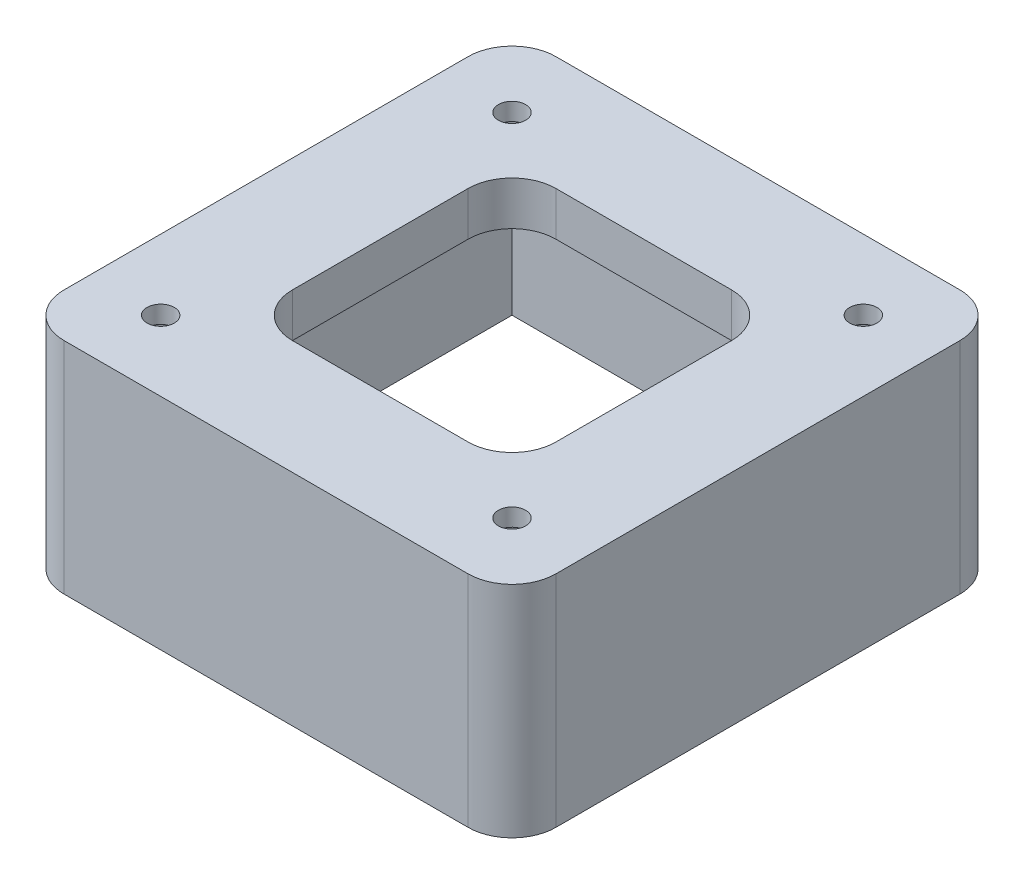
ISO-10303-21;
HEADER;
FILE_DESCRIPTION(('STEP AP214'),'2;1');
FILE_NAME('part.step','',(''),(''),'','','');
FILE_SCHEMA(('AUTOMOTIVE_DESIGN { 1 0 10303 214 1 1 1 1 }'));
ENDSEC;
DATA;
#1=APPLICATION_CONTEXT('core data for automotive mechanical design processes');
#2=APPLICATION_PROTOCOL_DEFINITION('international standard','automotive_design',2000,#1);
#3=PRODUCT_CONTEXT('',#1,'mechanical');
#4=PRODUCT('Part','Part','',(#3));
#5=PRODUCT_RELATED_PRODUCT_CATEGORY('part','',(#4));
#6=PRODUCT_DEFINITION_FORMATION('','',#4);
#7=PRODUCT_DEFINITION_CONTEXT('part definition',#1,'design');
#8=PRODUCT_DEFINITION('design','',#6,#7);
#9=PRODUCT_DEFINITION_SHAPE('','',#8);
#10=(LENGTH_UNIT() NAMED_UNIT(*) SI_UNIT(.MILLI.,.METRE.));
#11=(NAMED_UNIT(*) PLANE_ANGLE_UNIT() SI_UNIT($,.RADIAN.));
#12=(NAMED_UNIT(*) SI_UNIT($,.STERADIAN.) SOLID_ANGLE_UNIT());
#13=UNCERTAINTY_MEASURE_WITH_UNIT(LENGTH_MEASURE(1.E-05),#10,'distance_accuracy_value','');
#14=(GEOMETRIC_REPRESENTATION_CONTEXT(3) GLOBAL_UNCERTAINTY_ASSIGNED_CONTEXT((#13)) GLOBAL_UNIT_ASSIGNED_CONTEXT((#10,
#11,#12)) REPRESENTATION_CONTEXT('',''));
#15=CARTESIAN_POINT('',(0.,0.,0.));
#16=DIRECTION('',(0.,0.,1.));
#17=DIRECTION('',(1.,0.,0.));
#18=AXIS2_PLACEMENT_3D('',#15,#16,#17);
#19=CARTESIAN_POINT('',(-20.,5.,20.));
#20=DIRECTION('',(0.,-1.,0.));
#21=DIRECTION('',(0.,0.,-1.));
#22=AXIS2_PLACEMENT_3D('',#19,#20,#21);
#23=CYLINDRICAL_SURFACE('',#22,1.55);
#24=CARTESIAN_POINT('',(-20.,5.,20.));
#25=DIRECTION('',(0.,1.,0.));
#26=DIRECTION('',(0.,0.,1.));
#27=AXIS2_PLACEMENT_3D('',#24,#25,#26);
#28=CIRCLE('',#27,1.55);
#29=CARTESIAN_POINT('',(-20.,5.,21.55));
#30=VERTEX_POINT('',#29);
#31=EDGE_CURVE('E268',#30,#30,#28,.T.);
#32=ORIENTED_EDGE('',*,*,#31,.T.);
#33=EDGE_LOOP('',(#32));
#34=FACE_BOUND('',#33,.T.);
#35=CARTESIAN_POINT('',(-20.,3.,20.));
#36=DIRECTION('',(0.,-1.,0.));
#37=DIRECTION('',(0.,0.,-1.));
#38=AXIS2_PLACEMENT_3D('',#35,#36,#37);
#39=CIRCLE('',#38,1.55);
#40=CARTESIAN_POINT('',(-20.,3.,18.45));
#41=VERTEX_POINT('',#40);
#42=EDGE_CURVE('E231',#41,#41,#39,.T.);
#43=ORIENTED_EDGE('',*,*,#42,.T.);
#44=EDGE_LOOP('',(#43));
#45=FACE_BOUND('',#44,.T.);
#46=ADVANCED_FACE('F34',(#34,#45),#23,.F.);
#47=CARTESIAN_POINT('',(20.,5.,-20.));
#48=DIRECTION('',(0.,-1.,0.));
#49=DIRECTION('',(0.,0.,-1.));
#50=AXIS2_PLACEMENT_3D('',#47,#48,#49);
#51=CYLINDRICAL_SURFACE('',#50,1.55);
#52=CARTESIAN_POINT('',(20.,5.,-20.));
#53=DIRECTION('',(0.,1.,0.));
#54=DIRECTION('',(0.,0.,1.));
#55=AXIS2_PLACEMENT_3D('',#52,#53,#54);
#56=CIRCLE('',#55,1.55);
#57=CARTESIAN_POINT('',(20.,5.,-18.45));
#58=VERTEX_POINT('',#57);
#59=EDGE_CURVE('E285',#58,#58,#56,.T.);
#60=ORIENTED_EDGE('',*,*,#59,.T.);
#61=EDGE_LOOP('',(#60));
#62=FACE_BOUND('',#61,.T.);
#63=CARTESIAN_POINT('',(20.,3.,-20.));
#64=DIRECTION('',(0.,-1.,0.));
#65=DIRECTION('',(0.,0.,-1.));
#66=AXIS2_PLACEMENT_3D('',#63,#64,#65);
#67=CIRCLE('',#66,1.55);
#68=CARTESIAN_POINT('',(20.,3.,-21.55));
#69=VERTEX_POINT('',#68);
#70=EDGE_CURVE('E237',#69,#69,#67,.T.);
#71=ORIENTED_EDGE('',*,*,#70,.T.);
#72=EDGE_LOOP('',(#71));
#73=FACE_BOUND('',#72,.T.);
#74=ADVANCED_FACE('F413',(#62,#73),#51,.F.);
#75=CARTESIAN_POINT('',(-20.,5.,-20.));
#76=DIRECTION('',(0.,-1.,0.));
#77=DIRECTION('',(0.,0.,-1.));
#78=AXIS2_PLACEMENT_3D('',#75,#76,#77);
#79=CYLINDRICAL_SURFACE('',#78,1.55);
#80=CARTESIAN_POINT('',(-20.,5.,-20.));
#81=DIRECTION('',(0.,1.,0.));
#82=DIRECTION('',(0.,0.,1.));
#83=AXIS2_PLACEMENT_3D('',#80,#81,#82);
#84=CIRCLE('',#83,1.55);
#85=CARTESIAN_POINT('',(-20.,5.,-18.45));
#86=VERTEX_POINT('',#85);
#87=EDGE_CURVE('E288',#86,#86,#84,.T.);
#88=ORIENTED_EDGE('',*,*,#87,.T.);
#89=EDGE_LOOP('',(#88));
#90=FACE_BOUND('',#89,.T.);
#91=CARTESIAN_POINT('',(-20.,3.,-20.));
#92=DIRECTION('',(0.,-1.,0.));
#93=DIRECTION('',(0.,0.,-1.));
#94=AXIS2_PLACEMENT_3D('',#91,#92,#93);
#95=CIRCLE('',#94,1.55);
#96=CARTESIAN_POINT('',(-20.,3.,-21.55));
#97=VERTEX_POINT('',#96);
#98=EDGE_CURVE('E244',#97,#97,#95,.T.);
#99=ORIENTED_EDGE('',*,*,#98,.T.);
#100=EDGE_LOOP('',(#99));
#101=FACE_BOUND('',#100,.T.);
#102=ADVANCED_FACE('F419',(#90,#101),#79,.F.);
#103=CARTESIAN_POINT('',(20.,5.,20.));
#104=DIRECTION('',(0.,-1.,0.));
#105=DIRECTION('',(0.,0.,-1.));
#106=AXIS2_PLACEMENT_3D('',#103,#104,#105);
#107=CYLINDRICAL_SURFACE('',#106,1.55);
#108=CARTESIAN_POINT('',(20.,5.,20.));
#109=DIRECTION('',(0.,1.,0.));
#110=DIRECTION('',(0.,0.,1.));
#111=AXIS2_PLACEMENT_3D('',#108,#109,#110);
#112=CIRCLE('',#111,1.55);
#113=CARTESIAN_POINT('',(20.,5.,21.55));
#114=VERTEX_POINT('',#113);
#115=EDGE_CURVE('E282',#114,#114,#112,.T.);
#116=ORIENTED_EDGE('',*,*,#115,.T.);
#117=EDGE_LOOP('',(#116));
#118=FACE_BOUND('',#117,.T.);
#119=CARTESIAN_POINT('',(20.,3.,20.));
#120=DIRECTION('',(0.,-1.,0.));
#121=DIRECTION('',(0.,0.,-1.));
#122=AXIS2_PLACEMENT_3D('',#119,#120,#121);
#123=CIRCLE('',#122,1.55);
#124=CARTESIAN_POINT('',(20.,3.,18.45));
#125=VERTEX_POINT('',#124);
#126=EDGE_CURVE('E251',#125,#125,#123,.T.);
#127=ORIENTED_EDGE('',*,*,#126,.T.);
#128=EDGE_LOOP('',(#127));
#129=FACE_BOUND('',#128,.T.);
#130=ADVANCED_FACE('F427',(#118,#129),#107,.F.);
#131=CARTESIAN_POINT('',(0.,5.,0.));
#132=DIRECTION('',(0.,1.,0.));
#133=DIRECTION('',(0.,0.,1.));
#134=AXIS2_PLACEMENT_3D('',#131,#132,#133);
#135=PLANE('',#134);
#136=ORIENTED_EDGE('',*,*,#115,.F.);
#137=EDGE_LOOP('',(#136));
#138=FACE_BOUND('',#137,.T.);
#139=ORIENTED_EDGE('',*,*,#87,.F.);
#140=EDGE_LOOP('',(#139));
#141=FACE_BOUND('',#140,.T.);
#142=DIRECTION('',(1.,0.,0.));
#143=VECTOR('',#142,1.);
#144=CARTESIAN_POINT('',(28.,5.,28.));
#145=LINE('',#144,#143);
#146=CARTESIAN_POINT('',(-23.,5.,28.));
#147=VERTEX_POINT('',#146);
#148=CARTESIAN_POINT('',(23.,5.,28.));
#149=VERTEX_POINT('',#148);
#150=EDGE_CURVE('E294',#147,#149,#145,.T.);
#151=ORIENTED_EDGE('',*,*,#150,.T.);
#152=CARTESIAN_POINT('',(23.,5.,23.));
#153=DIRECTION('',(0.,1.,0.));
#154=DIRECTION('',(0.,0.,1.));
#155=AXIS2_PLACEMENT_3D('',#152,#153,#154);
#156=CIRCLE('',#155,5.);
#157=CARTESIAN_POINT('',(28.,5.,23.));
#158=VERTEX_POINT('',#157);
#159=EDGE_CURVE('E368',#149,#158,#156,.T.);
#160=ORIENTED_EDGE('',*,*,#159,.T.);
#161=DIRECTION('',(0.,0.,-1.));
#162=VECTOR('',#161,1.);
#163=CARTESIAN_POINT('',(28.,5.,28.));
#164=LINE('',#163,#162);
#165=CARTESIAN_POINT('',(28.,5.,-23.));
#166=VERTEX_POINT('',#165);
#167=EDGE_CURVE('E297',#158,#166,#164,.T.);
#168=ORIENTED_EDGE('',*,*,#167,.T.);
#169=CARTESIAN_POINT('',(23.,5.,-23.));
#170=DIRECTION('',(0.,1.,0.));
#171=DIRECTION('',(0.,0.,1.));
#172=AXIS2_PLACEMENT_3D('',#169,#170,#171);
#173=CIRCLE('',#172,5.);
#174=CARTESIAN_POINT('',(23.,5.,-28.));
#175=VERTEX_POINT('',#174);
#176=EDGE_CURVE('E56',#166,#175,#173,.T.);
#177=ORIENTED_EDGE('',*,*,#176,.T.);
#178=DIRECTION('',(-1.,0.,0.));
#179=VECTOR('',#178,1.);
#180=CARTESIAN_POINT('',(28.,5.,-28.));
#181=LINE('',#180,#179);
#182=CARTESIAN_POINT('',(-23.,5.,-28.));
#183=VERTEX_POINT('',#182);
#184=EDGE_CURVE('E299',#175,#183,#181,.T.);
#185=ORIENTED_EDGE('',*,*,#184,.T.);
#186=CARTESIAN_POINT('',(-23.,5.,-23.));
#187=DIRECTION('',(0.,1.,0.));
#188=DIRECTION('',(0.,0.,1.));
#189=AXIS2_PLACEMENT_3D('',#186,#187,#188);
#190=CIRCLE('',#189,5.);
#191=CARTESIAN_POINT('',(-28.,5.,-23.));
#192=VERTEX_POINT('',#191);
#193=EDGE_CURVE('E365',#183,#192,#190,.T.);
#194=ORIENTED_EDGE('',*,*,#193,.T.);
#195=DIRECTION('',(0.,0.,1.));
#196=VECTOR('',#195,1.);
#197=CARTESIAN_POINT('',(-28.,5.,28.));
#198=LINE('',#197,#196);
#199=CARTESIAN_POINT('',(-28.,5.,23.));
#200=VERTEX_POINT('',#199);
#201=EDGE_CURVE('E291',#192,#200,#198,.T.);
#202=ORIENTED_EDGE('',*,*,#201,.T.);
#203=CARTESIAN_POINT('',(-23.,5.,23.));
#204=DIRECTION('',(0.,1.,0.));
#205=DIRECTION('',(0.,0.,1.));
#206=AXIS2_PLACEMENT_3D('',#203,#204,#205);
#207=CIRCLE('',#206,5.);
#208=EDGE_CURVE('E363',#200,#147,#207,.T.);
#209=ORIENTED_EDGE('',*,*,#208,.T.);
#210=EDGE_LOOP('',(#151,#160,#168,#177,#185,#194,#202,#209));
#211=FACE_BOUND('',#210,.T.);
#212=ORIENTED_EDGE('',*,*,#59,.F.);
#213=EDGE_LOOP('',(#212));
#214=FACE_BOUND('',#213,.T.);
#215=ORIENTED_EDGE('',*,*,#31,.F.);
#216=EDGE_LOOP('',(#215));
#217=FACE_BOUND('',#216,.T.);
#218=DIRECTION('',(-1.,0.,0.));
#219=VECTOR('',#218,1.);
#220=CARTESIAN_POINT('',(-15.,5.,-15.));
#221=LINE('',#220,#219);
#222=CARTESIAN_POINT('',(10.,5.,-15.));
#223=VERTEX_POINT('',#222);
#224=CARTESIAN_POINT('',(-10.,5.,-15.));
#225=VERTEX_POINT('',#224);
#226=EDGE_CURVE('E258',#223,#225,#221,.T.);
#227=ORIENTED_EDGE('',*,*,#226,.F.);
#228=CARTESIAN_POINT('',(10.,5.,-10.));
#229=DIRECTION('',(0.,1.,0.));
#230=DIRECTION('',(0.,0.,1.));
#231=AXIS2_PLACEMENT_3D('',#228,#229,#230);
#232=CIRCLE('',#231,5.);
#233=CARTESIAN_POINT('',(15.,5.,-10.));
#234=VERTEX_POINT('',#233);
#235=EDGE_CURVE('E335',#223,#234,#232,.F.);
#236=ORIENTED_EDGE('',*,*,#235,.T.);
#237=DIRECTION('',(0.,0.,-1.));
#238=VECTOR('',#237,1.);
#239=CARTESIAN_POINT('',(15.,5.,15.));
#240=LINE('',#239,#238);
#241=CARTESIAN_POINT('',(15.,5.,9.99999999999999));
#242=VERTEX_POINT('',#241);
#243=EDGE_CURVE('E255',#242,#234,#240,.T.);
#244=ORIENTED_EDGE('',*,*,#243,.F.);
#245=CARTESIAN_POINT('',(10.,5.,9.99999999999999));
#246=DIRECTION('',(0.,1.,0.));
#247=DIRECTION('',(0.,0.,1.));
#248=AXIS2_PLACEMENT_3D('',#245,#246,#247);
#249=CIRCLE('',#248,5.);
#250=CARTESIAN_POINT('',(10.,5.,15.));
#251=VERTEX_POINT('',#250);
#252=EDGE_CURVE('E339',#242,#251,#249,.F.);
#253=ORIENTED_EDGE('',*,*,#252,.T.);
#254=DIRECTION('',(1.,0.,0.));
#255=VECTOR('',#254,1.);
#256=CARTESIAN_POINT('',(-15.,5.,15.));
#257=LINE('',#256,#255);
#258=CARTESIAN_POINT('',(-10.,5.,15.));
#259=VERTEX_POINT('',#258);
#260=EDGE_CURVE('E265',#259,#251,#257,.T.);
#261=ORIENTED_EDGE('',*,*,#260,.F.);
#262=CARTESIAN_POINT('',(-10.,5.,9.99999999999999));
#263=DIRECTION('',(0.,1.,0.));
#264=DIRECTION('',(0.,0.,1.));
#265=AXIS2_PLACEMENT_3D('',#262,#263,#264);
#266=CIRCLE('',#265,5.);
#267=CARTESIAN_POINT('',(-15.,5.,9.99999999999999));
#268=VERTEX_POINT('',#267);
#269=EDGE_CURVE('E343',#259,#268,#266,.F.);
#270=ORIENTED_EDGE('',*,*,#269,.T.);
#271=DIRECTION('',(0.,0.,1.));
#272=VECTOR('',#271,1.);
#273=CARTESIAN_POINT('',(-15.,5.,15.));
#274=LINE('',#273,#272);
#275=CARTESIAN_POINT('',(-15.,5.,-10.));
#276=VERTEX_POINT('',#275);
#277=EDGE_CURVE('E262',#276,#268,#274,.T.);
#278=ORIENTED_EDGE('',*,*,#277,.F.);
#279=CARTESIAN_POINT('',(-10.,5.,-10.));
#280=DIRECTION('',(0.,1.,0.));
#281=DIRECTION('',(0.,0.,1.));
#282=AXIS2_PLACEMENT_3D('',#279,#280,#281);
#283=CIRCLE('',#282,5.);
#284=EDGE_CURVE('E331',#276,#225,#283,.F.);
#285=ORIENTED_EDGE('',*,*,#284,.T.);
#286=EDGE_LOOP('',(#227,#236,#244,#253,#261,#270,#278,#285));
#287=FACE_BOUND('',#286,.T.);
#288=ADVANCED_FACE('F381',(#138,#141,#211,#214,#217,#287),#135,.T.);
#289=CARTESIAN_POINT('',(0.,0.,0.));
#290=DIRECTION('',(0.,1.,0.));
#291=DIRECTION('',(0.,0.,1.));
#292=AXIS2_PLACEMENT_3D('',#289,#290,#291);
#293=PLANE('',#292);
#294=DIRECTION('',(0.,0.,1.));
#295=VECTOR('',#294,1.);
#296=CARTESIAN_POINT('',(25.,0.,-25.));
#297=LINE('',#296,#295);
#298=CARTESIAN_POINT('',(25.,0.,-25.));
#299=VERTEX_POINT('',#298);
#300=CARTESIAN_POINT('',(25.,0.,25.));
#301=VERTEX_POINT('',#300);
#302=EDGE_CURVE('E185',#299,#301,#297,.T.);
#303=ORIENTED_EDGE('',*,*,#302,.T.);
#304=DIRECTION('',(-1.,0.,0.));
#305=VECTOR('',#304,1.);
#306=CARTESIAN_POINT('',(25.,0.,25.));
#307=LINE('',#306,#305);
#308=CARTESIAN_POINT('',(-25.,0.,25.));
#309=VERTEX_POINT('',#308);
#310=EDGE_CURVE('E204',#301,#309,#307,.T.);
#311=ORIENTED_EDGE('',*,*,#310,.T.);
#312=DIRECTION('',(0.,0.,-1.));
#313=VECTOR('',#312,1.);
#314=CARTESIAN_POINT('',(-25.,0.,25.));
#315=LINE('',#314,#313);
#316=CARTESIAN_POINT('',(-25.,0.,-25.));
#317=VERTEX_POINT('',#316);
#318=EDGE_CURVE('E191',#309,#317,#315,.T.);
#319=ORIENTED_EDGE('',*,*,#318,.T.);
#320=DIRECTION('',(1.,0.,0.));
#321=VECTOR('',#320,1.);
#322=CARTESIAN_POINT('',(-25.,0.,-25.));
#323=LINE('',#322,#321);
#324=EDGE_CURVE('E207',#317,#299,#323,.T.);
#325=ORIENTED_EDGE('',*,*,#324,.T.);
#326=EDGE_LOOP('',(#303,#311,#319,#325));
#327=FACE_BOUND('',#326,.T.);
#328=CARTESIAN_POINT('',(-20.,0.,20.));
#329=DIRECTION('',(0.,-1.,0.));
#330=DIRECTION('',(0.,0.,-1.));
#331=AXIS2_PLACEMENT_3D('',#328,#329,#330);
#332=CIRCLE('',#331,3.55);
#333=CARTESIAN_POINT('',(-20.,0.,16.45));
#334=VERTEX_POINT('',#333);
#335=EDGE_CURVE('E227',#334,#334,#332,.T.);
#336=ORIENTED_EDGE('',*,*,#335,.F.);
#337=EDGE_LOOP('',(#336));
#338=FACE_BOUND('',#337,.T.);
#339=CARTESIAN_POINT('',(20.,0.,-20.));
#340=DIRECTION('',(0.,-1.,0.));
#341=DIRECTION('',(0.,0.,-1.));
#342=AXIS2_PLACEMENT_3D('',#339,#340,#341);
#343=CIRCLE('',#342,3.55);
#344=CARTESIAN_POINT('',(20.,0.,-23.55));
#345=VERTEX_POINT('',#344);
#346=EDGE_CURVE('E238',#345,#345,#343,.T.);
#347=ORIENTED_EDGE('',*,*,#346,.F.);
#348=EDGE_LOOP('',(#347));
#349=FACE_BOUND('',#348,.T.);
#350=CARTESIAN_POINT('',(-20.,0.,-20.));
#351=DIRECTION('',(0.,-1.,0.));
#352=DIRECTION('',(0.,0.,-1.));
#353=AXIS2_PLACEMENT_3D('',#350,#351,#352);
#354=CIRCLE('',#353,3.55);
#355=CARTESIAN_POINT('',(-20.,0.,-23.55));
#356=VERTEX_POINT('',#355);
#357=EDGE_CURVE('E245',#356,#356,#354,.T.);
#358=ORIENTED_EDGE('',*,*,#357,.F.);
#359=EDGE_LOOP('',(#358));
#360=FACE_BOUND('',#359,.T.);
#361=CARTESIAN_POINT('',(20.,0.,20.));
#362=DIRECTION('',(0.,-1.,0.));
#363=DIRECTION('',(0.,0.,-1.));
#364=AXIS2_PLACEMENT_3D('',#361,#362,#363);
#365=CIRCLE('',#364,3.55);
#366=CARTESIAN_POINT('',(20.,0.,16.45));
#367=VERTEX_POINT('',#366);
#368=EDGE_CURVE('E252',#367,#367,#365,.T.);
#369=ORIENTED_EDGE('',*,*,#368,.F.);
#370=EDGE_LOOP('',(#369));
#371=FACE_BOUND('',#370,.T.);
#372=DIRECTION('',(1.,0.,0.));
#373=VECTOR('',#372,1.);
#374=CARTESIAN_POINT('',(-15.,0.,15.));
#375=LINE('',#374,#373);
#376=CARTESIAN_POINT('',(-10.,0.,15.));
#377=VERTEX_POINT('',#376);
#378=CARTESIAN_POINT('',(10.,0.,15.));
#379=VERTEX_POINT('',#378);
#380=EDGE_CURVE('E259',#377,#379,#375,.T.);
#381=ORIENTED_EDGE('',*,*,#380,.T.);
#382=CARTESIAN_POINT('',(10.,0.,9.99999999999999));
#383=DIRECTION('',(0.,1.,0.));
#384=DIRECTION('',(0.,0.,1.));
#385=AXIS2_PLACEMENT_3D('',#382,#383,#384);
#386=CIRCLE('',#385,5.);
#387=CARTESIAN_POINT('',(15.,0.,9.99999999999999));
#388=VERTEX_POINT('',#387);
#389=EDGE_CURVE('E337',#379,#388,#386,.T.);
#390=ORIENTED_EDGE('',*,*,#389,.T.);
#391=DIRECTION('',(0.,0.,-1.));
#392=VECTOR('',#391,1.);
#393=CARTESIAN_POINT('',(15.,0.,15.));
#394=LINE('',#393,#392);
#395=CARTESIAN_POINT('',(15.,0.,-10.));
#396=VERTEX_POINT('',#395);
#397=EDGE_CURVE('E269',#388,#396,#394,.T.);
#398=ORIENTED_EDGE('',*,*,#397,.T.);
#399=CARTESIAN_POINT('',(10.,0.,-10.));
#400=DIRECTION('',(0.,1.,0.));
#401=DIRECTION('',(0.,0.,1.));
#402=AXIS2_PLACEMENT_3D('',#399,#400,#401);
#403=CIRCLE('',#402,5.);
#404=CARTESIAN_POINT('',(10.,0.,-15.));
#405=VERTEX_POINT('',#404);
#406=EDGE_CURVE('E333',#396,#405,#403,.T.);
#407=ORIENTED_EDGE('',*,*,#406,.T.);
#408=DIRECTION('',(-1.,0.,0.));
#409=VECTOR('',#408,1.);
#410=CARTESIAN_POINT('',(-15.,0.,-15.));
#411=LINE('',#410,#409);
#412=CARTESIAN_POINT('',(-10.,0.,-15.));
#413=VERTEX_POINT('',#412);
#414=EDGE_CURVE('E272',#405,#413,#411,.T.);
#415=ORIENTED_EDGE('',*,*,#414,.T.);
#416=CARTESIAN_POINT('',(-10.,0.,-10.));
#417=DIRECTION('',(0.,1.,0.));
#418=DIRECTION('',(0.,0.,1.));
#419=AXIS2_PLACEMENT_3D('',#416,#417,#418);
#420=CIRCLE('',#419,5.);
#421=CARTESIAN_POINT('',(-15.,0.,-10.));
#422=VERTEX_POINT('',#421);
#423=EDGE_CURVE('E329',#413,#422,#420,.T.);
#424=ORIENTED_EDGE('',*,*,#423,.T.);
#425=DIRECTION('',(0.,0.,1.));
#426=VECTOR('',#425,1.);
#427=CARTESIAN_POINT('',(-15.,0.,15.));
#428=LINE('',#427,#426);
#429=CARTESIAN_POINT('',(-15.,0.,9.99999999999999));
#430=VERTEX_POINT('',#429);
#431=EDGE_CURVE('E275',#422,#430,#428,.T.);
#432=ORIENTED_EDGE('',*,*,#431,.T.);
#433=CARTESIAN_POINT('',(-10.,0.,9.99999999999999));
#434=DIRECTION('',(0.,1.,0.));
#435=DIRECTION('',(0.,0.,1.));
#436=AXIS2_PLACEMENT_3D('',#433,#434,#435);
#437=CIRCLE('',#436,5.);
#438=EDGE_CURVE('E341',#430,#377,#437,.T.);
#439=ORIENTED_EDGE('',*,*,#438,.T.);
#440=EDGE_LOOP('',(#381,#390,#398,#407,#415,#424,#432,#439));
#441=FACE_BOUND('',#440,.T.);
#442=ADVANCED_FACE('F436',(#327,#338,#349,#360,#371,#441),#293,.F.);
#443=CARTESIAN_POINT('',(-28.,5.,28.));
#444=DIRECTION('',(1.,0.,0.));
#445=DIRECTION('',(0.,0.,-1.));
#446=AXIS2_PLACEMENT_3D('',#443,#444,#445);
#447=PLANE('',#446);
#448=ORIENTED_EDGE('',*,*,#201,.F.);
#449=DIRECTION('',(0.,-1.,0.));
#450=VECTOR('',#449,1.);
#451=CARTESIAN_POINT('',(-28.,5.,-23.));
#452=LINE('',#451,#450);
#453=CARTESIAN_POINT('',(-28.,-20.,-23.));
#454=VERTEX_POINT('',#453);
#455=EDGE_CURVE('E11',#192,#454,#452,.T.);
#456=ORIENTED_EDGE('',*,*,#455,.T.);
#457=DIRECTION('',(0.,0.,-1.));
#458=VECTOR('',#457,1.);
#459=CARTESIAN_POINT('',(-28.,-20.,28.));
#460=LINE('',#459,#458);
#461=CARTESIAN_POINT('',(-28.,-20.,23.));
#462=VERTEX_POINT('',#461);
#463=EDGE_CURVE('E218',#462,#454,#460,.T.);
#464=ORIENTED_EDGE('',*,*,#463,.F.);
#465=DIRECTION('',(0.,-1.,0.));
#466=VECTOR('',#465,1.);
#467=CARTESIAN_POINT('',(-28.,5.,23.));
#468=LINE('',#467,#466);
#469=EDGE_CURVE('E42',#462,#200,#468,.F.);
#470=ORIENTED_EDGE('',*,*,#469,.T.);
#471=EDGE_LOOP('',(#448,#456,#464,#470));
#472=FACE_BOUND('',#471,.T.);
#473=ADVANCED_FACE('F377',(#472),#447,.F.);
#474=CARTESIAN_POINT('',(28.,5.,28.));
#475=DIRECTION('',(0.,0.,-1.));
#476=DIRECTION('',(-1.,0.,0.));
#477=AXIS2_PLACEMENT_3D('',#474,#475,#476);
#478=PLANE('',#477);
#479=DIRECTION('',(-1.,0.,0.));
#480=VECTOR('',#479,1.);
#481=CARTESIAN_POINT('',(28.,-20.,28.));
#482=LINE('',#481,#480);
#483=CARTESIAN_POINT('',(23.,-20.,28.));
#484=VERTEX_POINT('',#483);
#485=CARTESIAN_POINT('',(-23.,-20.,28.));
#486=VERTEX_POINT('',#485);
#487=EDGE_CURVE('E192',#484,#486,#482,.T.);
#488=ORIENTED_EDGE('',*,*,#487,.F.);
#489=DIRECTION('',(0.,-1.,0.));
#490=VECTOR('',#489,1.);
#491=CARTESIAN_POINT('',(23.,5.,28.));
#492=LINE('',#491,#490);
#493=EDGE_CURVE('E361',#484,#149,#492,.F.);
#494=ORIENTED_EDGE('',*,*,#493,.T.);
#495=ORIENTED_EDGE('',*,*,#150,.F.);
#496=DIRECTION('',(0.,-1.,0.));
#497=VECTOR('',#496,1.);
#498=CARTESIAN_POINT('',(-23.,5.,28.));
#499=LINE('',#498,#497);
#500=EDGE_CURVE('E358',#147,#486,#499,.T.);
#501=ORIENTED_EDGE('',*,*,#500,.T.);
#502=EDGE_LOOP('',(#488,#494,#495,#501));
#503=FACE_BOUND('',#502,.T.);
#504=ADVANCED_FACE('F388',(#503),#478,.F.);
#505=CARTESIAN_POINT('',(28.,5.,28.));
#506=DIRECTION('',(-1.,0.,0.));
#507=DIRECTION('',(0.,0.,1.));
#508=AXIS2_PLACEMENT_3D('',#505,#506,#507);
#509=PLANE('',#508);
#510=ORIENTED_EDGE('',*,*,#167,.F.);
#511=DIRECTION('',(0.,-1.,0.));
#512=VECTOR('',#511,1.);
#513=CARTESIAN_POINT('',(28.,5.,23.));
#514=LINE('',#513,#512);
#515=CARTESIAN_POINT('',(28.,-20.,23.));
#516=VERTEX_POINT('',#515);
#517=EDGE_CURVE('E347',#158,#516,#514,.T.);
#518=ORIENTED_EDGE('',*,*,#517,.T.);
#519=DIRECTION('',(0.,0.,1.));
#520=VECTOR('',#519,1.);
#521=CARTESIAN_POINT('',(28.,-20.,-28.));
#522=LINE('',#521,#520);
#523=CARTESIAN_POINT('',(28.,-20.,-23.));
#524=VERTEX_POINT('',#523);
#525=EDGE_CURVE('E224',#524,#516,#522,.T.);
#526=ORIENTED_EDGE('',*,*,#525,.F.);
#527=DIRECTION('',(0.,-1.,0.));
#528=VECTOR('',#527,1.);
#529=CARTESIAN_POINT('',(28.,5.,-23.));
#530=LINE('',#529,#528);
#531=EDGE_CURVE('E345',#524,#166,#530,.F.);
#532=ORIENTED_EDGE('',*,*,#531,.T.);
#533=EDGE_LOOP('',(#510,#518,#526,#532));
#534=FACE_BOUND('',#533,.T.);
#535=ADVANCED_FACE('F398',(#534),#509,.F.);
#536=CARTESIAN_POINT('',(28.,5.,-28.));
#537=DIRECTION('',(0.,0.,1.));
#538=DIRECTION('',(1.,0.,0.));
#539=AXIS2_PLACEMENT_3D('',#536,#537,#538);
#540=PLANE('',#539);
#541=ORIENTED_EDGE('',*,*,#184,.F.);
#542=DIRECTION('',(0.,-1.,0.));
#543=VECTOR('',#542,1.);
#544=CARTESIAN_POINT('',(23.,5.,-28.));
#545=LINE('',#544,#543);
#546=CARTESIAN_POINT('',(23.,-20.,-28.));
#547=VERTEX_POINT('',#546);
#548=EDGE_CURVE('E371',#175,#547,#545,.T.);
#549=ORIENTED_EDGE('',*,*,#548,.T.);
#550=DIRECTION('',(1.,0.,0.));
#551=VECTOR('',#550,1.);
#552=CARTESIAN_POINT('',(-28.,-20.,-28.));
#553=LINE('',#552,#551);
#554=CARTESIAN_POINT('',(-23.,-20.,-28.));
#555=VERTEX_POINT('',#554);
#556=EDGE_CURVE('E221',#555,#547,#553,.T.);
#557=ORIENTED_EDGE('',*,*,#556,.F.);
#558=DIRECTION('',(0.,-1.,0.));
#559=VECTOR('',#558,1.);
#560=CARTESIAN_POINT('',(-23.,5.,-28.));
#561=LINE('',#560,#559);
#562=EDGE_CURVE('E49',#555,#183,#561,.F.);
#563=ORIENTED_EDGE('',*,*,#562,.T.);
#564=EDGE_LOOP('',(#541,#549,#557,#563));
#565=FACE_BOUND('',#564,.T.);
#566=ADVANCED_FACE('F403',(#565),#540,.F.);
#567=CARTESIAN_POINT('',(15.,5.,15.));
#568=DIRECTION('',(-1.,0.,0.));
#569=DIRECTION('',(0.,0.,1.));
#570=AXIS2_PLACEMENT_3D('',#567,#568,#569);
#571=PLANE('',#570);
#572=ORIENTED_EDGE('',*,*,#243,.T.);
#573=DIRECTION('',(0.,-1.,0.));
#574=VECTOR('',#573,1.);
#575=CARTESIAN_POINT('',(15.,0.,-10.));
#576=LINE('',#575,#574);
#577=EDGE_CURVE('E321',#234,#396,#576,.T.);
#578=ORIENTED_EDGE('',*,*,#577,.T.);
#579=ORIENTED_EDGE('',*,*,#397,.F.);
#580=DIRECTION('',(0.,-1.,0.));
#581=VECTOR('',#580,1.);
#582=CARTESIAN_POINT('',(15.,5.,9.99999999999999));
#583=LINE('',#582,#581);
#584=EDGE_CURVE('E319',#388,#242,#583,.F.);
#585=ORIENTED_EDGE('',*,*,#584,.T.);
#586=EDGE_LOOP('',(#572,#578,#579,#585));
#587=FACE_BOUND('',#586,.T.);
#588=ADVANCED_FACE('F425',(#587),#571,.T.);
#589=CARTESIAN_POINT('',(-15.,5.,-15.));
#590=DIRECTION('',(0.,0.,1.));
#591=DIRECTION('',(1.,0.,0.));
#592=AXIS2_PLACEMENT_3D('',#589,#590,#591);
#593=PLANE('',#592);
#594=ORIENTED_EDGE('',*,*,#226,.T.);
#595=DIRECTION('',(0.,-1.,0.));
#596=VECTOR('',#595,1.);
#597=CARTESIAN_POINT('',(-10.,0.,-15.));
#598=LINE('',#597,#596);
#599=EDGE_CURVE('E311',#225,#413,#598,.T.);
#600=ORIENTED_EDGE('',*,*,#599,.T.);
#601=ORIENTED_EDGE('',*,*,#414,.F.);
#602=DIRECTION('',(0.,-1.,0.));
#603=VECTOR('',#602,1.);
#604=CARTESIAN_POINT('',(10.,5.,-15.));
#605=LINE('',#604,#603);
#606=EDGE_CURVE('E301',#405,#223,#605,.F.);
#607=ORIENTED_EDGE('',*,*,#606,.T.);
#608=EDGE_LOOP('',(#594,#600,#601,#607));
#609=FACE_BOUND('',#608,.T.);
#610=ADVANCED_FACE('F524',(#609),#593,.T.);
#611=CARTESIAN_POINT('',(-15.,5.,15.));
#612=DIRECTION('',(1.,0.,0.));
#613=DIRECTION('',(0.,0.,-1.));
#614=AXIS2_PLACEMENT_3D('',#611,#612,#613);
#615=PLANE('',#614);
#616=ORIENTED_EDGE('',*,*,#431,.F.);
#617=DIRECTION('',(0.,-1.,0.));
#618=VECTOR('',#617,1.);
#619=CARTESIAN_POINT('',(-15.,5.,-10.));
#620=LINE('',#619,#618);
#621=EDGE_CURVE('E317',#422,#276,#620,.F.);
#622=ORIENTED_EDGE('',*,*,#621,.T.);
#623=ORIENTED_EDGE('',*,*,#277,.T.);
#624=DIRECTION('',(0.,-1.,0.));
#625=VECTOR('',#624,1.);
#626=CARTESIAN_POINT('',(-15.,0.,9.99999999999999));
#627=LINE('',#626,#625);
#628=EDGE_CURVE('E314',#268,#430,#627,.T.);
#629=ORIENTED_EDGE('',*,*,#628,.T.);
#630=EDGE_LOOP('',(#616,#622,#623,#629));
#631=FACE_BOUND('',#630,.T.);
#632=ADVANCED_FACE('F521',(#631),#615,.T.);
#633=CARTESIAN_POINT('',(-15.,5.,15.));
#634=DIRECTION('',(0.,0.,-1.));
#635=DIRECTION('',(-1.,0.,0.));
#636=AXIS2_PLACEMENT_3D('',#633,#634,#635);
#637=PLANE('',#636);
#638=ORIENTED_EDGE('',*,*,#260,.T.);
#639=DIRECTION('',(0.,-1.,0.));
#640=VECTOR('',#639,1.);
#641=CARTESIAN_POINT('',(10.,0.,15.));
#642=LINE('',#641,#640);
#643=EDGE_CURVE('E326',#251,#379,#642,.T.);
#644=ORIENTED_EDGE('',*,*,#643,.T.);
#645=ORIENTED_EDGE('',*,*,#380,.F.);
#646=DIRECTION('',(0.,-1.,0.));
#647=VECTOR('',#646,1.);
#648=CARTESIAN_POINT('',(-10.,5.,15.));
#649=LINE('',#648,#647);
#650=EDGE_CURVE('E324',#377,#259,#649,.F.);
#651=ORIENTED_EDGE('',*,*,#650,.T.);
#652=EDGE_LOOP('',(#638,#644,#645,#651));
#653=FACE_BOUND('',#652,.T.);
#654=ADVANCED_FACE('F517',(#653),#637,.T.);
#655=CARTESIAN_POINT('',(20.,3.,20.));
#656=DIRECTION('',(0.,-1.,0.));
#657=DIRECTION('',(0.,0.,-1.));
#658=AXIS2_PLACEMENT_3D('',#655,#656,#657);
#659=CYLINDRICAL_SURFACE('',#658,3.55);
#660=CARTESIAN_POINT('',(20.,3.,20.));
#661=DIRECTION('',(0.,-1.,0.));
#662=DIRECTION('',(0.,0.,-1.));
#663=AXIS2_PLACEMENT_3D('',#660,#661,#662);
#664=CIRCLE('',#663,3.55);
#665=CARTESIAN_POINT('',(20.,3.,16.45));
#666=VERTEX_POINT('',#665);
#667=EDGE_CURVE('E248',#666,#666,#664,.T.);
#668=ORIENTED_EDGE('',*,*,#667,.F.);
#669=EDGE_LOOP('',(#668));
#670=FACE_BOUND('',#669,.T.);
#671=ORIENTED_EDGE('',*,*,#368,.T.);
#672=EDGE_LOOP('',(#671));
#673=FACE_BOUND('',#672,.T.);
#674=ADVANCED_FACE('F513',(#670,#673),#659,.F.);
#675=CARTESIAN_POINT('',(20.,3.,20.));
#676=DIRECTION('',(0.,-1.,0.));
#677=DIRECTION('',(0.,0.,-1.));
#678=AXIS2_PLACEMENT_3D('',#675,#676,#677);
#679=PLANE('',#678);
#680=ORIENTED_EDGE('',*,*,#126,.F.);
#681=EDGE_LOOP('',(#680));
#682=FACE_BOUND('',#681,.T.);
#683=ORIENTED_EDGE('',*,*,#667,.T.);
#684=EDGE_LOOP('',(#683));
#685=FACE_BOUND('',#684,.T.);
#686=ADVANCED_FACE('F509',(#682,#685),#679,.T.);
#687=CARTESIAN_POINT('',(-20.,3.,-20.));
#688=DIRECTION('',(0.,-1.,0.));
#689=DIRECTION('',(0.,0.,-1.));
#690=AXIS2_PLACEMENT_3D('',#687,#688,#689);
#691=CYLINDRICAL_SURFACE('',#690,3.55);
#692=CARTESIAN_POINT('',(-20.,3.,-20.));
#693=DIRECTION('',(0.,-1.,0.));
#694=DIRECTION('',(0.,0.,-1.));
#695=AXIS2_PLACEMENT_3D('',#692,#693,#694);
#696=CIRCLE('',#695,3.55);
#697=CARTESIAN_POINT('',(-20.,3.,-23.55));
#698=VERTEX_POINT('',#697);
#699=EDGE_CURVE('E241',#698,#698,#696,.T.);
#700=ORIENTED_EDGE('',*,*,#699,.F.);
#701=EDGE_LOOP('',(#700));
#702=FACE_BOUND('',#701,.T.);
#703=ORIENTED_EDGE('',*,*,#357,.T.);
#704=EDGE_LOOP('',(#703));
#705=FACE_BOUND('',#704,.T.);
#706=ADVANCED_FACE('F505',(#702,#705),#691,.F.);
#707=CARTESIAN_POINT('',(-20.,3.,-20.));
#708=DIRECTION('',(0.,-1.,0.));
#709=DIRECTION('',(0.,0.,-1.));
#710=AXIS2_PLACEMENT_3D('',#707,#708,#709);
#711=PLANE('',#710);
#712=ORIENTED_EDGE('',*,*,#98,.F.);
#713=EDGE_LOOP('',(#712));
#714=FACE_BOUND('',#713,.T.);
#715=ORIENTED_EDGE('',*,*,#699,.T.);
#716=EDGE_LOOP('',(#715));
#717=FACE_BOUND('',#716,.T.);
#718=ADVANCED_FACE('F501',(#714,#717),#711,.T.);
#719=CARTESIAN_POINT('',(20.,3.,-20.));
#720=DIRECTION('',(0.,-1.,0.));
#721=DIRECTION('',(0.,0.,-1.));
#722=AXIS2_PLACEMENT_3D('',#719,#720,#721);
#723=CYLINDRICAL_SURFACE('',#722,3.55);
#724=CARTESIAN_POINT('',(20.,3.,-20.));
#725=DIRECTION('',(0.,-1.,0.));
#726=DIRECTION('',(0.,0.,-1.));
#727=AXIS2_PLACEMENT_3D('',#724,#725,#726);
#728=CIRCLE('',#727,3.55);
#729=CARTESIAN_POINT('',(20.,3.,-23.55));
#730=VERTEX_POINT('',#729);
#731=EDGE_CURVE('E234',#730,#730,#728,.T.);
#732=ORIENTED_EDGE('',*,*,#731,.F.);
#733=EDGE_LOOP('',(#732));
#734=FACE_BOUND('',#733,.T.);
#735=ORIENTED_EDGE('',*,*,#346,.T.);
#736=EDGE_LOOP('',(#735));
#737=FACE_BOUND('',#736,.T.);
#738=ADVANCED_FACE('F497',(#734,#737),#723,.F.);
#739=CARTESIAN_POINT('',(20.,3.,-20.));
#740=DIRECTION('',(0.,-1.,0.));
#741=DIRECTION('',(0.,0.,-1.));
#742=AXIS2_PLACEMENT_3D('',#739,#740,#741);
#743=PLANE('',#742);
#744=ORIENTED_EDGE('',*,*,#70,.F.);
#745=EDGE_LOOP('',(#744));
#746=FACE_BOUND('',#745,.T.);
#747=ORIENTED_EDGE('',*,*,#731,.T.);
#748=EDGE_LOOP('',(#747));
#749=FACE_BOUND('',#748,.T.);
#750=ADVANCED_FACE('F493',(#746,#749),#743,.T.);
#751=CARTESIAN_POINT('',(-20.,3.,20.));
#752=DIRECTION('',(0.,-1.,0.));
#753=DIRECTION('',(0.,0.,-1.));
#754=AXIS2_PLACEMENT_3D('',#751,#752,#753);
#755=CYLINDRICAL_SURFACE('',#754,3.55);
#756=CARTESIAN_POINT('',(-20.,3.,20.));
#757=DIRECTION('',(0.,-1.,0.));
#758=DIRECTION('',(0.,0.,-1.));
#759=AXIS2_PLACEMENT_3D('',#756,#757,#758);
#760=CIRCLE('',#759,3.55);
#761=CARTESIAN_POINT('',(-20.,3.,16.45));
#762=VERTEX_POINT('',#761);
#763=EDGE_CURVE('E228',#762,#762,#760,.T.);
#764=ORIENTED_EDGE('',*,*,#763,.F.);
#765=EDGE_LOOP('',(#764));
#766=FACE_BOUND('',#765,.T.);
#767=ORIENTED_EDGE('',*,*,#335,.T.);
#768=EDGE_LOOP('',(#767));
#769=FACE_BOUND('',#768,.T.);
#770=ADVANCED_FACE('F489',(#766,#769),#755,.F.);
#771=CARTESIAN_POINT('',(-20.,3.,20.));
#772=DIRECTION('',(0.,-1.,0.));
#773=DIRECTION('',(0.,0.,-1.));
#774=AXIS2_PLACEMENT_3D('',#771,#772,#773);
#775=PLANE('',#774);
#776=ORIENTED_EDGE('',*,*,#42,.F.);
#777=EDGE_LOOP('',(#776));
#778=FACE_BOUND('',#777,.T.);
#779=ORIENTED_EDGE('',*,*,#763,.T.);
#780=EDGE_LOOP('',(#779));
#781=FACE_BOUND('',#780,.T.);
#782=ADVANCED_FACE('F453',(#778,#781),#775,.T.);
#783=CARTESIAN_POINT('',(-10.,5.,-10.));
#784=DIRECTION('',(0.,1.,0.));
#785=DIRECTION('',(0.,0.,1.));
#786=AXIS2_PLACEMENT_3D('',#783,#784,#785);
#787=CYLINDRICAL_SURFACE('',#786,5.);
#788=ORIENTED_EDGE('',*,*,#284,.F.);
#789=ORIENTED_EDGE('',*,*,#621,.F.);
#790=ORIENTED_EDGE('',*,*,#423,.F.);
#791=ORIENTED_EDGE('',*,*,#599,.F.);
#792=EDGE_LOOP('',(#788,#789,#790,#791));
#793=FACE_BOUND('',#792,.T.);
#794=ADVANCED_FACE('F449',(#793),#787,.F.);
#795=CARTESIAN_POINT('',(10.,5.,-10.));
#796=DIRECTION('',(0.,1.,0.));
#797=DIRECTION('',(0.,0.,1.));
#798=AXIS2_PLACEMENT_3D('',#795,#796,#797);
#799=CYLINDRICAL_SURFACE('',#798,5.);
#800=ORIENTED_EDGE('',*,*,#235,.F.);
#801=ORIENTED_EDGE('',*,*,#606,.F.);
#802=ORIENTED_EDGE('',*,*,#406,.F.);
#803=ORIENTED_EDGE('',*,*,#577,.F.);
#804=EDGE_LOOP('',(#800,#801,#802,#803));
#805=FACE_BOUND('',#804,.T.);
#806=ADVANCED_FACE('F452',(#805),#799,.F.);
#807=CARTESIAN_POINT('',(10.,5.,9.99999999999999));
#808=DIRECTION('',(0.,1.,0.));
#809=DIRECTION('',(0.,0.,1.));
#810=AXIS2_PLACEMENT_3D('',#807,#808,#809);
#811=CYLINDRICAL_SURFACE('',#810,5.);
#812=ORIENTED_EDGE('',*,*,#252,.F.);
#813=ORIENTED_EDGE('',*,*,#584,.F.);
#814=ORIENTED_EDGE('',*,*,#389,.F.);
#815=ORIENTED_EDGE('',*,*,#643,.F.);
#816=EDGE_LOOP('',(#812,#813,#814,#815));
#817=FACE_BOUND('',#816,.T.);
#818=ADVANCED_FACE('F457',(#817),#811,.F.);
#819=CARTESIAN_POINT('',(-10.,5.,9.99999999999999));
#820=DIRECTION('',(0.,1.,0.));
#821=DIRECTION('',(0.,0.,1.));
#822=AXIS2_PLACEMENT_3D('',#819,#820,#821);
#823=CYLINDRICAL_SURFACE('',#822,5.);
#824=ORIENTED_EDGE('',*,*,#269,.F.);
#825=ORIENTED_EDGE('',*,*,#650,.F.);
#826=ORIENTED_EDGE('',*,*,#438,.F.);
#827=ORIENTED_EDGE('',*,*,#628,.F.);
#828=EDGE_LOOP('',(#824,#825,#826,#827));
#829=FACE_BOUND('',#828,.T.);
#830=ADVANCED_FACE('F461',(#829),#823,.F.);
#831=CARTESIAN_POINT('',(0.,-20.,0.));
#832=DIRECTION('',(0.,-1.,0.));
#833=DIRECTION('',(0.,0.,-1.));
#834=AXIS2_PLACEMENT_3D('',#831,#832,#833);
#835=PLANE('',#834);
#836=ORIENTED_EDGE('',*,*,#525,.T.);
#837=CARTESIAN_POINT('',(23.,-20.,23.));
#838=DIRECTION('',(0.,-1.,0.));
#839=DIRECTION('',(0.,0.,-1.));
#840=AXIS2_PLACEMENT_3D('',#837,#838,#839);
#841=CIRCLE('',#840,5.);
#842=EDGE_CURVE('E356',#516,#484,#841,.T.);
#843=ORIENTED_EDGE('',*,*,#842,.T.);
#844=ORIENTED_EDGE('',*,*,#487,.T.);
#845=CARTESIAN_POINT('',(-23.,-20.,23.));
#846=DIRECTION('',(0.,-1.,0.));
#847=DIRECTION('',(0.,0.,-1.));
#848=AXIS2_PLACEMENT_3D('',#845,#846,#847);
#849=CIRCLE('',#848,5.);
#850=EDGE_CURVE('E350',#486,#462,#849,.T.);
#851=ORIENTED_EDGE('',*,*,#850,.T.);
#852=ORIENTED_EDGE('',*,*,#463,.T.);
#853=CARTESIAN_POINT('',(-23.,-20.,-23.));
#854=DIRECTION('',(0.,-1.,0.));
#855=DIRECTION('',(0.,0.,-1.));
#856=AXIS2_PLACEMENT_3D('',#853,#854,#855);
#857=CIRCLE('',#856,5.);
#858=EDGE_CURVE('E352',#454,#555,#857,.T.);
#859=ORIENTED_EDGE('',*,*,#858,.T.);
#860=ORIENTED_EDGE('',*,*,#556,.T.);
#861=CARTESIAN_POINT('',(23.,-20.,-23.));
#862=DIRECTION('',(0.,-1.,0.));
#863=DIRECTION('',(0.,0.,-1.));
#864=AXIS2_PLACEMENT_3D('',#861,#862,#863);
#865=CIRCLE('',#864,5.);
#866=EDGE_CURVE('E354',#547,#524,#865,.T.);
#867=ORIENTED_EDGE('',*,*,#866,.T.);
#868=EDGE_LOOP('',(#836,#843,#844,#851,#852,#859,#860,#867));
#869=FACE_BOUND('',#868,.T.);
#870=DIRECTION('',(0.,0.,-1.));
#871=VECTOR('',#870,1.);
#872=CARTESIAN_POINT('',(-25.,-20.,25.));
#873=LINE('',#872,#871);
#874=CARTESIAN_POINT('',(-25.,-20.,25.));
#875=VERTEX_POINT('',#874);
#876=CARTESIAN_POINT('',(-25.,-20.,-25.));
#877=VERTEX_POINT('',#876);
#878=EDGE_CURVE('E184',#875,#877,#873,.T.);
#879=ORIENTED_EDGE('',*,*,#878,.F.);
#880=DIRECTION('',(-1.,0.,0.));
#881=VECTOR('',#880,1.);
#882=CARTESIAN_POINT('',(25.,-20.,25.));
#883=LINE('',#882,#881);
#884=CARTESIAN_POINT('',(25.,-20.,25.));
#885=VERTEX_POINT('',#884);
#886=EDGE_CURVE('E174',#885,#875,#883,.T.);
#887=ORIENTED_EDGE('',*,*,#886,.F.);
#888=DIRECTION('',(0.,0.,1.));
#889=VECTOR('',#888,1.);
#890=CARTESIAN_POINT('',(25.,-20.,-25.));
#891=LINE('',#890,#889);
#892=CARTESIAN_POINT('',(25.,-20.,-25.));
#893=VERTEX_POINT('',#892);
#894=EDGE_CURVE('E200',#893,#885,#891,.T.);
#895=ORIENTED_EDGE('',*,*,#894,.F.);
#896=DIRECTION('',(1.,0.,0.));
#897=VECTOR('',#896,1.);
#898=CARTESIAN_POINT('',(-25.,-20.,-25.));
#899=LINE('',#898,#897);
#900=EDGE_CURVE('E198',#877,#893,#899,.T.);
#901=ORIENTED_EDGE('',*,*,#900,.F.);
#902=EDGE_LOOP('',(#879,#887,#895,#901));
#903=FACE_BOUND('',#902,.T.);
#904=ADVANCED_FACE('F196',(#869,#903),#835,.T.);
#905=CARTESIAN_POINT('',(25.,-20.,25.));
#906=DIRECTION('',(0.,0.,-1.));
#907=DIRECTION('',(-1.,0.,0.));
#908=AXIS2_PLACEMENT_3D('',#905,#906,#907);
#909=PLANE('',#908);
#910=ORIENTED_EDGE('',*,*,#310,.F.);
#911=DIRECTION('',(0.,1.,0.));
#912=VECTOR('',#911,1.);
#913=CARTESIAN_POINT('',(25.,-20.,25.));
#914=LINE('',#913,#912);
#915=EDGE_CURVE('E180',#885,#301,#914,.T.);
#916=ORIENTED_EDGE('',*,*,#915,.F.);
#917=ORIENTED_EDGE('',*,*,#886,.T.);
#918=DIRECTION('',(0.,1.,0.));
#919=VECTOR('',#918,1.);
#920=CARTESIAN_POINT('',(-25.,-20.,25.));
#921=LINE('',#920,#919);
#922=EDGE_CURVE('E178',#875,#309,#921,.T.);
#923=ORIENTED_EDGE('',*,*,#922,.T.);
#924=EDGE_LOOP('',(#910,#916,#917,#923));
#925=FACE_BOUND('',#924,.T.);
#926=ADVANCED_FACE('F177',(#925),#909,.T.);
#927=CARTESIAN_POINT('',(-25.,-20.,25.));
#928=DIRECTION('',(1.,0.,0.));
#929=DIRECTION('',(0.,0.,-1.));
#930=AXIS2_PLACEMENT_3D('',#927,#928,#929);
#931=PLANE('',#930);
#932=ORIENTED_EDGE('',*,*,#318,.F.);
#933=ORIENTED_EDGE('',*,*,#922,.F.);
#934=ORIENTED_EDGE('',*,*,#878,.T.);
#935=DIRECTION('',(0.,1.,0.));
#936=VECTOR('',#935,1.);
#937=CARTESIAN_POINT('',(-25.,-20.,-25.));
#938=LINE('',#937,#936);
#939=EDGE_CURVE('E193',#877,#317,#938,.T.);
#940=ORIENTED_EDGE('',*,*,#939,.T.);
#941=EDGE_LOOP('',(#932,#933,#934,#940));
#942=FACE_BOUND('',#941,.T.);
#943=ADVANCED_FACE('F188',(#942),#931,.T.);
#944=CARTESIAN_POINT('',(-25.,-20.,-25.));
#945=DIRECTION('',(0.,0.,1.));
#946=DIRECTION('',(1.,0.,0.));
#947=AXIS2_PLACEMENT_3D('',#944,#945,#946);
#948=PLANE('',#947);
#949=ORIENTED_EDGE('',*,*,#324,.F.);
#950=ORIENTED_EDGE('',*,*,#939,.F.);
#951=ORIENTED_EDGE('',*,*,#900,.T.);
#952=DIRECTION('',(0.,1.,0.));
#953=VECTOR('',#952,1.);
#954=CARTESIAN_POINT('',(25.,-20.,-25.));
#955=LINE('',#954,#953);
#956=EDGE_CURVE('E213',#893,#299,#955,.T.);
#957=ORIENTED_EDGE('',*,*,#956,.T.);
#958=EDGE_LOOP('',(#949,#950,#951,#957));
#959=FACE_BOUND('',#958,.T.);
#960=ADVANCED_FACE('F471',(#959),#948,.T.);
#961=CARTESIAN_POINT('',(25.,-20.,-25.));
#962=DIRECTION('',(-1.,0.,0.));
#963=DIRECTION('',(0.,0.,1.));
#964=AXIS2_PLACEMENT_3D('',#961,#962,#963);
#965=PLANE('',#964);
#966=ORIENTED_EDGE('',*,*,#302,.F.);
#967=ORIENTED_EDGE('',*,*,#956,.F.);
#968=ORIENTED_EDGE('',*,*,#894,.T.);
#969=ORIENTED_EDGE('',*,*,#915,.T.);
#970=EDGE_LOOP('',(#966,#967,#968,#969));
#971=FACE_BOUND('',#970,.T.);
#972=ADVANCED_FACE('F467',(#971),#965,.T.);
#973=CARTESIAN_POINT('',(23.,5.,23.));
#974=DIRECTION('',(0.,-1.,0.));
#975=DIRECTION('',(0.,0.,-1.));
#976=AXIS2_PLACEMENT_3D('',#973,#974,#975);
#977=CYLINDRICAL_SURFACE('',#976,5.);
#978=ORIENTED_EDGE('',*,*,#159,.F.);
#979=ORIENTED_EDGE('',*,*,#493,.F.);
#980=ORIENTED_EDGE('',*,*,#842,.F.);
#981=ORIENTED_EDGE('',*,*,#517,.F.);
#982=EDGE_LOOP('',(#978,#979,#980,#981));
#983=FACE_BOUND('',#982,.T.);
#984=ADVANCED_FACE('F395',(#983),#977,.T.);
#985=CARTESIAN_POINT('',(23.,5.,-23.));
#986=DIRECTION('',(0.,-1.,0.));
#987=DIRECTION('',(0.,0.,-1.));
#988=AXIS2_PLACEMENT_3D('',#985,#986,#987);
#989=CYLINDRICAL_SURFACE('',#988,5.);
#990=ORIENTED_EDGE('',*,*,#176,.F.);
#991=ORIENTED_EDGE('',*,*,#531,.F.);
#992=ORIENTED_EDGE('',*,*,#866,.F.);
#993=ORIENTED_EDGE('',*,*,#548,.F.);
#994=EDGE_LOOP('',(#990,#991,#992,#993));
#995=FACE_BOUND('',#994,.T.);
#996=ADVANCED_FACE('F402',(#995),#989,.T.);
#997=CARTESIAN_POINT('',(-23.,5.,-23.));
#998=DIRECTION('',(0.,-1.,0.));
#999=DIRECTION('',(0.,0.,-1.));
#1000=AXIS2_PLACEMENT_3D('',#997,#998,#999);
#1001=CYLINDRICAL_SURFACE('',#1000,5.);
#1002=ORIENTED_EDGE('',*,*,#193,.F.);
#1003=ORIENTED_EDGE('',*,*,#562,.F.);
#1004=ORIENTED_EDGE('',*,*,#858,.F.);
#1005=ORIENTED_EDGE('',*,*,#455,.F.);
#1006=EDGE_LOOP('',(#1002,#1003,#1004,#1005));
#1007=FACE_BOUND('',#1006,.T.);
#1008=ADVANCED_FACE('F405',(#1007),#1001,.T.);
#1009=CARTESIAN_POINT('',(-23.,5.,23.));
#1010=DIRECTION('',(0.,-1.,0.));
#1011=DIRECTION('',(0.,0.,-1.));
#1012=AXIS2_PLACEMENT_3D('',#1009,#1010,#1011);
#1013=CYLINDRICAL_SURFACE('',#1012,5.);
#1014=ORIENTED_EDGE('',*,*,#208,.F.);
#1015=ORIENTED_EDGE('',*,*,#469,.F.);
#1016=ORIENTED_EDGE('',*,*,#850,.F.);
#1017=ORIENTED_EDGE('',*,*,#500,.F.);
#1018=EDGE_LOOP('',(#1014,#1015,#1016,#1017));
#1019=FACE_BOUND('',#1018,.T.);
#1020=ADVANCED_FACE('F36',(#1019),#1013,.T.);
#1021=CLOSED_SHELL('',(#46,#74,#102,#130,#288,#442,#473,#504,#535,#566,#588,#610,#632,#654,#674,
#686,#706,#718,#738,#750,#770,#782,#794,#806,#818,#830,#904,#926,#943,#960,#972,#984,#996,#1008,#1020));
#1022=MANIFOLD_SOLID_BREP('B2',#1021);
#1023=ADVANCED_BREP_SHAPE_REPRESENTATION('',(#18,#1022),#14);
#1024=SHAPE_DEFINITION_REPRESENTATION(#9,#1023);
ENDSEC;
END-ISO-10303-21;
